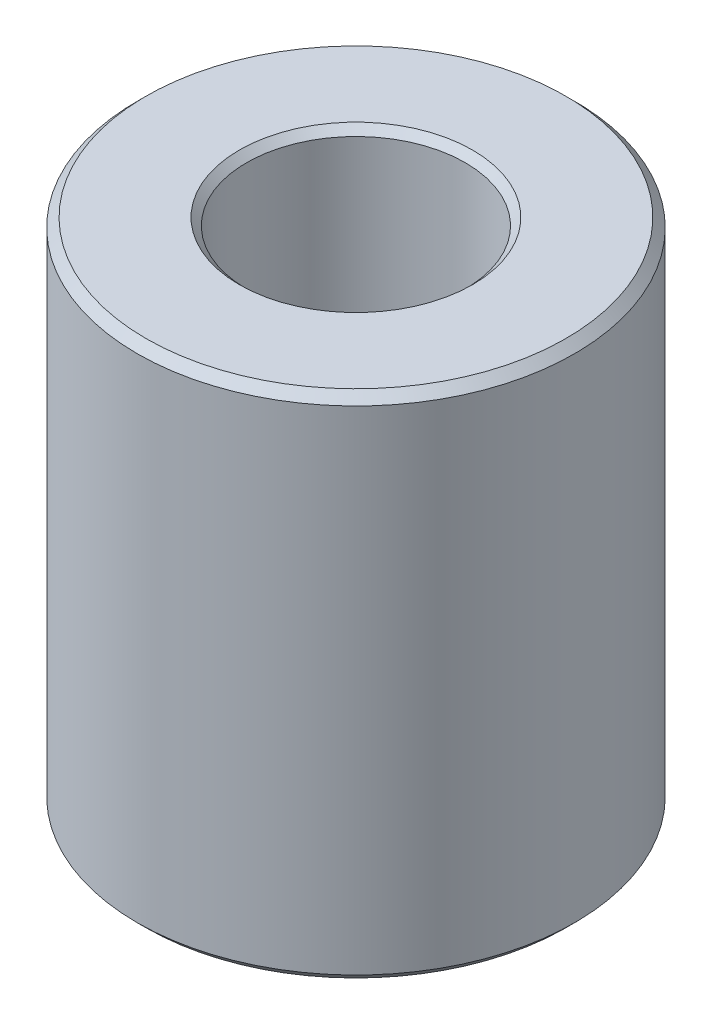
ISO-10303-21;
HEADER;
FILE_DESCRIPTION(('STEP AP214'),'2;1');
FILE_NAME('part.step','',(''),(''),'','','');
FILE_SCHEMA(('AUTOMOTIVE_DESIGN { 1 0 10303 214 1 1 1 1 }'));
ENDSEC;
DATA;
#1=APPLICATION_CONTEXT('core data for automotive mechanical design processes');
#2=APPLICATION_PROTOCOL_DEFINITION('international standard','automotive_design',2000,#1);
#3=PRODUCT_CONTEXT('',#1,'mechanical');
#4=PRODUCT('Part','Part','',(#3));
#5=PRODUCT_RELATED_PRODUCT_CATEGORY('part','',(#4));
#6=PRODUCT_DEFINITION_FORMATION('','',#4);
#7=PRODUCT_DEFINITION_CONTEXT('part definition',#1,'design');
#8=PRODUCT_DEFINITION('design','',#6,#7);
#9=PRODUCT_DEFINITION_SHAPE('','',#8);
#10=(LENGTH_UNIT() NAMED_UNIT(*) SI_UNIT(.MILLI.,.METRE.));
#11=(NAMED_UNIT(*) PLANE_ANGLE_UNIT() SI_UNIT($,.RADIAN.));
#12=(NAMED_UNIT(*) SI_UNIT($,.STERADIAN.) SOLID_ANGLE_UNIT());
#13=UNCERTAINTY_MEASURE_WITH_UNIT(LENGTH_MEASURE(1.E-05),#10,'distance_accuracy_value','');
#14=(GEOMETRIC_REPRESENTATION_CONTEXT(3) GLOBAL_UNCERTAINTY_ASSIGNED_CONTEXT((#13)) GLOBAL_UNIT_ASSIGNED_CONTEXT((#10,
#11,#12)) REPRESENTATION_CONTEXT('',''));
#15=CARTESIAN_POINT('',(0.,0.,0.));
#16=DIRECTION('',(0.,0.,1.));
#17=DIRECTION('',(1.,0.,0.));
#18=AXIS2_PLACEMENT_3D('',#15,#16,#17);
#19=CARTESIAN_POINT('',(0.,44.45,0.));
#20=DIRECTION('',(0.,-1.,0.));
#21=DIRECTION('',(0.,0.,-1.));
#22=AXIS2_PLACEMENT_3D('',#19,#20,#21);
#23=CYLINDRICAL_SURFACE('',#22,19.05);
#24=CARTESIAN_POINT('',(0.,0.762000000000006,0.));
#25=DIRECTION('',(0.,1.,0.));
#26=DIRECTION('',(0.,0.,1.));
#27=AXIS2_PLACEMENT_3D('',#24,#25,#26);
#28=CIRCLE('',#27,19.05);
#29=CARTESIAN_POINT('',(0.,0.762000000000006,19.05));
#30=VERTEX_POINT('',#29);
#31=EDGE_CURVE('E55',#30,#30,#28,.T.);
#32=ORIENTED_EDGE('',*,*,#31,.T.);
#33=EDGE_LOOP('',(#32));
#34=FACE_BOUND('',#33,.T.);
#35=CARTESIAN_POINT('',(0.,43.688,0.));
#36=DIRECTION('',(0.,1.,0.));
#37=DIRECTION('',(0.,0.,1.));
#38=AXIS2_PLACEMENT_3D('',#35,#36,#37);
#39=CIRCLE('',#38,19.05);
#40=CARTESIAN_POINT('',(0.,43.688,19.05));
#41=VERTEX_POINT('',#40);
#42=EDGE_CURVE('E58',#41,#41,#39,.F.);
#43=ORIENTED_EDGE('',*,*,#42,.T.);
#44=EDGE_LOOP('',(#43));
#45=FACE_BOUND('',#44,.T.);
#46=ADVANCED_FACE('F30',(#34,#45),#23,.T.);
#47=CARTESIAN_POINT('',(0.,44.45,0.));
#48=DIRECTION('',(0.,1.,0.));
#49=DIRECTION('',(0.,0.,1.));
#50=AXIS2_PLACEMENT_3D('',#47,#48,#49);
#51=PLANE('',#50);
#52=CARTESIAN_POINT('',(0.,44.45,0.));
#53=DIRECTION('',(0.,1.,0.));
#54=DIRECTION('',(0.,0.,1.));
#55=AXIS2_PLACEMENT_3D('',#52,#53,#54);
#56=CIRCLE('',#55,10.16);
#57=CARTESIAN_POINT('',(0.,44.45,10.16));
#58=VERTEX_POINT('',#57);
#59=EDGE_CURVE('E68',#58,#58,#56,.T.);
#60=ORIENTED_EDGE('',*,*,#59,.F.);
#61=EDGE_LOOP('',(#60));
#62=FACE_BOUND('',#61,.T.);
#63=CARTESIAN_POINT('',(0.,44.45,0.));
#64=DIRECTION('',(0.,1.,0.));
#65=DIRECTION('',(0.,0.,1.));
#66=AXIS2_PLACEMENT_3D('',#63,#64,#65);
#67=CIRCLE('',#66,18.288);
#68=CARTESIAN_POINT('',(0.,44.45,18.288));
#69=VERTEX_POINT('',#68);
#70=EDGE_CURVE('E41',#69,#69,#67,.T.);
#71=ORIENTED_EDGE('',*,*,#70,.T.);
#72=EDGE_LOOP('',(#71));
#73=FACE_BOUND('',#72,.T.);
#74=ADVANCED_FACE('F74',(#62,#73),#51,.T.);
#75=CARTESIAN_POINT('',(0.,0.,0.));
#76=DIRECTION('',(0.,1.,0.));
#77=DIRECTION('',(0.,0.,1.));
#78=AXIS2_PLACEMENT_3D('',#75,#76,#77);
#79=PLANE('',#78);
#80=CARTESIAN_POINT('',(0.,0.,0.));
#81=DIRECTION('',(0.,1.,0.));
#82=DIRECTION('',(0.,0.,1.));
#83=AXIS2_PLACEMENT_3D('',#80,#81,#82);
#84=CIRCLE('',#83,18.288);
#85=CARTESIAN_POINT('',(0.,0.,18.288));
#86=VERTEX_POINT('',#85);
#87=EDGE_CURVE('E45',#86,#86,#84,.F.);
#88=ORIENTED_EDGE('',*,*,#87,.T.);
#89=EDGE_LOOP('',(#88));
#90=FACE_BOUND('',#89,.T.);
#91=CARTESIAN_POINT('',(0.,0.,0.));
#92=DIRECTION('',(0.,1.,0.));
#93=DIRECTION('',(0.,0.,1.));
#94=AXIS2_PLACEMENT_3D('',#91,#92,#93);
#95=CIRCLE('',#94,5.41019999999999);
#96=CARTESIAN_POINT('',(0.,0.,5.41019999999999));
#97=VERTEX_POINT('',#96);
#98=EDGE_CURVE('E50',#97,#97,#95,.T.);
#99=ORIENTED_EDGE('',*,*,#98,.T.);
#100=EDGE_LOOP('',(#99));
#101=FACE_BOUND('',#100,.T.);
#102=ADVANCED_FACE('F77',(#90,#101),#79,.F.);
#103=CARTESIAN_POINT('',(0.,44.45,0.));
#104=DIRECTION('',(0.,1.,0.));
#105=DIRECTION('',(0.,0.,1.));
#106=AXIS2_PLACEMENT_3D('',#103,#104,#105);
#107=CYLINDRICAL_SURFACE('',#106,4.77519999999999);
#108=CARTESIAN_POINT('',(0.,8.382,0.));
#109=DIRECTION('',(0.,-1.,0.));
#110=DIRECTION('',(0.,0.,-1.));
#111=AXIS2_PLACEMENT_3D('',#108,#109,#110);
#112=CIRCLE('',#111,4.77519999999999);
#113=CARTESIAN_POINT('',(0.,8.382,-4.77519999999999));
#114=VERTEX_POINT('',#113);
#115=EDGE_CURVE('E48',#114,#114,#112,.F.);
#116=ORIENTED_EDGE('',*,*,#115,.T.);
#117=EDGE_LOOP('',(#116));
#118=FACE_BOUND('',#117,.T.);
#119=CARTESIAN_POINT('',(0.,0.635000000000004,0.));
#120=DIRECTION('',(0.,1.,0.));
#121=DIRECTION('',(0.,0.,1.));
#122=AXIS2_PLACEMENT_3D('',#119,#120,#121);
#123=CIRCLE('',#122,4.77519999999999);
#124=CARTESIAN_POINT('',(0.,0.635000000000004,4.77519999999999));
#125=VERTEX_POINT('',#124);
#126=EDGE_CURVE('E61',#125,#125,#123,.T.);
#127=ORIENTED_EDGE('',*,*,#126,.F.);
#128=EDGE_LOOP('',(#127));
#129=FACE_BOUND('',#128,.T.);
#130=ADVANCED_FACE('F104',(#118,#129),#107,.F.);
#131=CARTESIAN_POINT('',(0.,0.635000000000004,0.));
#132=DIRECTION('',(0.,-1.,0.));
#133=DIRECTION('',(0.,0.,-1.));
#134=AXIS2_PLACEMENT_3D('',#131,#132,#133);
#135=CONICAL_SURFACE('',#134,4.77519999999999,0.785398163397445);
#136=ORIENTED_EDGE('',*,*,#98,.F.);
#137=EDGE_LOOP('',(#136));
#138=FACE_BOUND('',#137,.T.);
#139=ORIENTED_EDGE('',*,*,#126,.T.);
#140=EDGE_LOOP('',(#139));
#141=FACE_BOUND('',#140,.T.);
#142=ADVANCED_FACE('F92',(#138,#141),#135,.F.);
#143=CARTESIAN_POINT('',(0.,0.762000000000006,0.));
#144=DIRECTION('',(0.,1.,0.));
#145=DIRECTION('',(0.,0.,1.));
#146=AXIS2_PLACEMENT_3D('',#143,#144,#145);
#147=CONICAL_SURFACE('',#146,19.05,0.785398163397446);
#148=ORIENTED_EDGE('',*,*,#87,.F.);
#149=EDGE_LOOP('',(#148));
#150=FACE_BOUND('',#149,.T.);
#151=ORIENTED_EDGE('',*,*,#31,.F.);
#152=EDGE_LOOP('',(#151));
#153=FACE_BOUND('',#152,.T.);
#154=ADVANCED_FACE('F84',(#150,#153),#147,.T.);
#155=CARTESIAN_POINT('',(0.,44.45,0.));
#156=DIRECTION('',(0.,-1.,0.));
#157=DIRECTION('',(0.,0.,-1.));
#158=AXIS2_PLACEMENT_3D('',#155,#156,#157);
#159=CONICAL_SURFACE('',#158,18.288,0.785398163397446);
#160=ORIENTED_EDGE('',*,*,#42,.F.);
#161=EDGE_LOOP('',(#160));
#162=FACE_BOUND('',#161,.T.);
#163=ORIENTED_EDGE('',*,*,#70,.F.);
#164=EDGE_LOOP('',(#163));
#165=FACE_BOUND('',#164,.T.);
#166=ADVANCED_FACE('F81',(#162,#165),#159,.T.);
#167=CARTESIAN_POINT('',(0.,8.382,0.));
#168=DIRECTION('',(0.,-1.,0.));
#169=DIRECTION('',(0.,0.,-1.));
#170=AXIS2_PLACEMENT_3D('',#167,#168,#169);
#171=PLANE('',#170);
#172=CARTESIAN_POINT('',(0.,8.382,0.));
#173=DIRECTION('',(0.,-1.,0.));
#174=DIRECTION('',(0.,0.,-1.));
#175=AXIS2_PLACEMENT_3D('',#172,#173,#174);
#176=CIRCLE('',#175,9.27099999999999);
#177=CARTESIAN_POINT('',(0.,8.382,-9.27099999999999));
#178=VERTEX_POINT('',#177);
#179=EDGE_CURVE('E37',#178,#178,#176,.F.);
#180=ORIENTED_EDGE('',*,*,#179,.T.);
#181=EDGE_LOOP('',(#180));
#182=FACE_BOUND('',#181,.T.);
#183=ORIENTED_EDGE('',*,*,#115,.F.);
#184=EDGE_LOOP('',(#183));
#185=FACE_BOUND('',#184,.T.);
#186=ADVANCED_FACE('F83',(#182,#185),#171,.F.);
#187=CARTESIAN_POINT('',(0.,44.45,0.));
#188=DIRECTION('',(0.,1.,0.));
#189=DIRECTION('',(0.,0.,1.));
#190=AXIS2_PLACEMENT_3D('',#187,#188,#189);
#191=CYLINDRICAL_SURFACE('',#190,9.52499999999999);
#192=CARTESIAN_POINT('',(0.,8.636,0.));
#193=DIRECTION('',(0.,-1.,0.));
#194=DIRECTION('',(0.,0.,-1.));
#195=AXIS2_PLACEMENT_3D('',#192,#193,#194);
#196=CIRCLE('',#195,9.52499999999999);
#197=CARTESIAN_POINT('',(0.,8.636,-9.52499999999999));
#198=VERTEX_POINT('',#197);
#199=EDGE_CURVE('E10',#198,#198,#196,.T.);
#200=ORIENTED_EDGE('',*,*,#199,.T.);
#201=EDGE_LOOP('',(#200));
#202=FACE_BOUND('',#201,.T.);
#203=CARTESIAN_POINT('',(0.,43.815,0.));
#204=DIRECTION('',(0.,1.,0.));
#205=DIRECTION('',(0.,0.,1.));
#206=AXIS2_PLACEMENT_3D('',#203,#204,#205);
#207=CIRCLE('',#206,9.525);
#208=CARTESIAN_POINT('',(0.,43.815,9.525));
#209=VERTEX_POINT('',#208);
#210=EDGE_CURVE('E51',#209,#209,#207,.T.);
#211=ORIENTED_EDGE('',*,*,#210,.T.);
#212=EDGE_LOOP('',(#211));
#213=FACE_BOUND('',#212,.T.);
#214=ADVANCED_FACE('F90',(#202,#213),#191,.F.);
#215=CARTESIAN_POINT('',(0.,44.45,0.));
#216=DIRECTION('',(0.,1.,0.));
#217=DIRECTION('',(0.,0.,1.));
#218=AXIS2_PLACEMENT_3D('',#215,#216,#217);
#219=CONICAL_SURFACE('',#218,10.16,0.78539816339745);
#220=ORIENTED_EDGE('',*,*,#210,.F.);
#221=EDGE_LOOP('',(#220));
#222=FACE_BOUND('',#221,.T.);
#223=ORIENTED_EDGE('',*,*,#59,.T.);
#224=EDGE_LOOP('',(#223));
#225=FACE_BOUND('',#224,.T.);
#226=ADVANCED_FACE('F72',(#222,#225),#219,.F.);
#227=CARTESIAN_POINT('',(0.,8.382,0.));
#228=DIRECTION('',(0.,1.,0.));
#229=DIRECTION('',(0.,0.,1.));
#230=AXIS2_PLACEMENT_3D('',#227,#228,#229);
#231=CONICAL_SURFACE('',#230,9.27099999999999,0.785398163397448);
#232=ORIENTED_EDGE('',*,*,#199,.F.);
#233=EDGE_LOOP('',(#232));
#234=FACE_BOUND('',#233,.T.);
#235=ORIENTED_EDGE('',*,*,#179,.F.);
#236=EDGE_LOOP('',(#235));
#237=FACE_BOUND('',#236,.T.);
#238=ADVANCED_FACE('F32',(#234,#237),#231,.F.);
#239=CLOSED_SHELL('',(#46,#74,#102,#130,#142,#154,#166,#186,#214,#226,#238));
#240=MANIFOLD_SOLID_BREP('B2',#239);
#241=ADVANCED_BREP_SHAPE_REPRESENTATION('',(#18,#240),#14);
#242=SHAPE_DEFINITION_REPRESENTATION(#9,#241);
ENDSEC;
END-ISO-10303-21;
